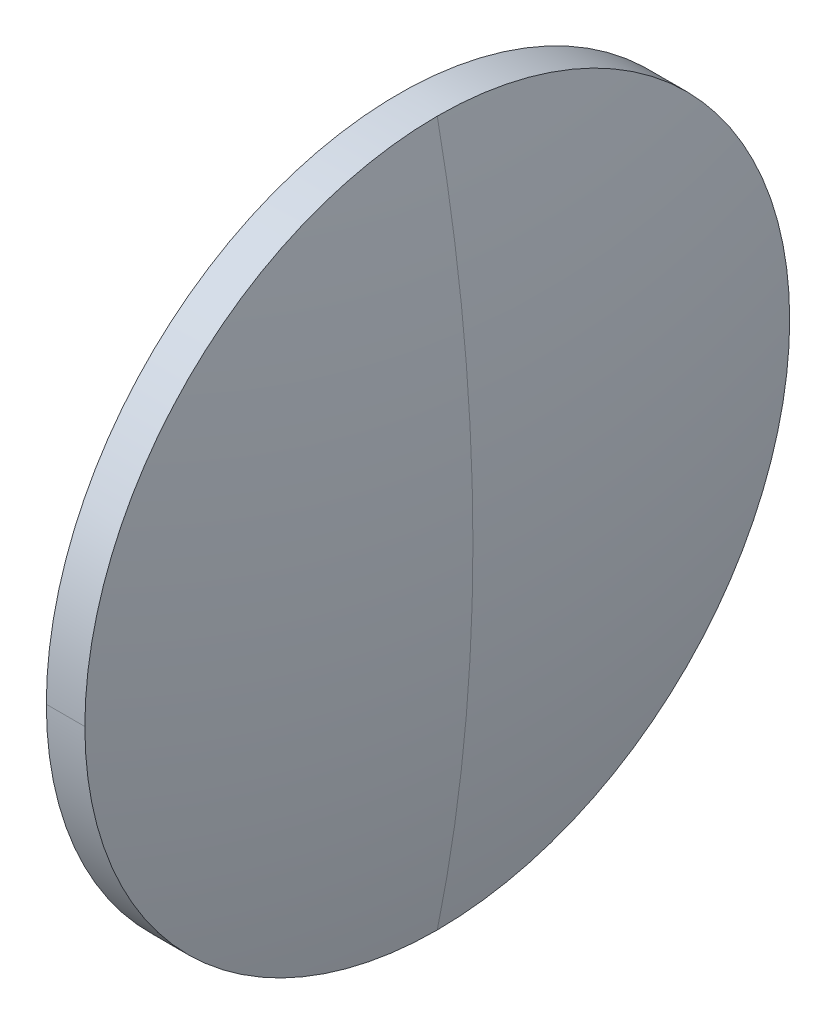
ISO-10303-21;
HEADER;
FILE_DESCRIPTION(('STEP AP214'),'2;1');
FILE_NAME('part.step','',(''),(''),'','','');
FILE_SCHEMA(('AUTOMOTIVE_DESIGN { 1 0 10303 214 1 1 1 1 }'));
ENDSEC;
DATA;
#1=APPLICATION_CONTEXT('core data for automotive mechanical design processes');
#2=APPLICATION_PROTOCOL_DEFINITION('international standard','automotive_design',2000,#1);
#3=PRODUCT_CONTEXT('',#1,'mechanical');
#4=PRODUCT('Part','Part','',(#3));
#5=PRODUCT_RELATED_PRODUCT_CATEGORY('part','',(#4));
#6=PRODUCT_DEFINITION_FORMATION('','',#4);
#7=PRODUCT_DEFINITION_CONTEXT('part definition',#1,'design');
#8=PRODUCT_DEFINITION('design','',#6,#7);
#9=PRODUCT_DEFINITION_SHAPE('','',#8);
#10=(LENGTH_UNIT() NAMED_UNIT(*) SI_UNIT(.MILLI.,.METRE.));
#11=(NAMED_UNIT(*) PLANE_ANGLE_UNIT() SI_UNIT($,.RADIAN.));
#12=(NAMED_UNIT(*) SI_UNIT($,.STERADIAN.) SOLID_ANGLE_UNIT());
#13=UNCERTAINTY_MEASURE_WITH_UNIT(LENGTH_MEASURE(1.E-05),#10,'distance_accuracy_value','');
#14=(GEOMETRIC_REPRESENTATION_CONTEXT(3) GLOBAL_UNCERTAINTY_ASSIGNED_CONTEXT((#13)) GLOBAL_UNIT_ASSIGNED_CONTEXT((#10,
#11,#12)) REPRESENTATION_CONTEXT('',''));
#15=CARTESIAN_POINT('',(0.,0.,0.));
#16=DIRECTION('',(0.,0.,1.));
#17=DIRECTION('',(1.,0.,0.));
#18=AXIS2_PLACEMENT_3D('',#15,#16,#17);
#19=CARTESIAN_POINT('',(2807.77536665739,-224.917697129705,0.));
#20=DIRECTION('',(-1.,0.,0.));
#21=DIRECTION('',(0.,0.,1.));
#22=AXIS2_PLACEMENT_3D('',#19,#20,#21);
#23=CYLINDRICAL_SURFACE('',#22,19.0000004602766);
#24=DIRECTION('',(-1.,0.,0.));
#25=VECTOR('',#24,1.);
#26=CARTESIAN_POINT('',(2807.77536665739,-224.917697129705,-19.0000004602766));
#27=LINE('',#26,#25);
#28=CARTESIAN_POINT('',(2816.62047491904,-224.917697129705,-19.0000004602766));
#29=VERTEX_POINT('',#28);
#30=CARTESIAN_POINT('',(2814.54281325368,-224.917697129705,-19.0000004602766));
#31=VERTEX_POINT('',#30);
#32=EDGE_CURVE('E89',#29,#31,#27,.T.);
#33=ORIENTED_EDGE('',*,*,#32,.F.);
#34=CARTESIAN_POINT('',(2816.62047491904,-224.917697129705,0.));
#35=DIRECTION('',(-1.,0.,0.));
#36=DIRECTION('',(0.,0.,1.));
#37=AXIS2_PLACEMENT_3D('',#34,#35,#36);
#38=CIRCLE('',#37,19.0000004602766);
#39=CARTESIAN_POINT('',(2816.62047491904,-243.917697589982,0.));
#40=VERTEX_POINT('',#39);
#41=EDGE_CURVE('E67',#29,#40,#38,.T.);
#42=ORIENTED_EDGE('',*,*,#41,.T.);
#43=CARTESIAN_POINT('',(2816.62047491904,-224.917697129705,0.));
#44=DIRECTION('',(-1.,0.,0.));
#45=DIRECTION('',(0.,0.,1.));
#46=AXIS2_PLACEMENT_3D('',#43,#44,#45);
#47=CIRCLE('',#46,19.0000004602766);
#48=CARTESIAN_POINT('',(2816.62047491904,-224.917697129705,19.0000004602766));
#49=VERTEX_POINT('',#48);
#50=EDGE_CURVE('E9',#40,#49,#47,.T.);
#51=ORIENTED_EDGE('',*,*,#50,.T.);
#52=DIRECTION('',(-1.,0.,0.));
#53=VECTOR('',#52,1.);
#54=CARTESIAN_POINT('',(2807.77536665739,-224.917697129705,19.0000004602766));
#55=LINE('',#54,#53);
#56=CARTESIAN_POINT('',(2814.54281325368,-224.917697129705,19.0000004602766));
#57=VERTEX_POINT('',#56);
#58=EDGE_CURVE('E85',#49,#57,#55,.T.);
#59=ORIENTED_EDGE('',*,*,#58,.T.);
#60=CARTESIAN_POINT('',(2814.54281325368,-224.917697129705,0.));
#61=DIRECTION('',(-1.,0.,0.));
#62=DIRECTION('',(0.,0.,1.));
#63=AXIS2_PLACEMENT_3D('',#60,#61,#62);
#64=CIRCLE('',#63,19.0000004602766);
#65=EDGE_CURVE('E26',#31,#57,#64,.T.);
#66=ORIENTED_EDGE('',*,*,#65,.F.);
#67=EDGE_LOOP('',(#33,#42,#51,#59,#66));
#68=FACE_BOUND('',#67,.T.);
#69=ADVANCED_FACE('F15',(#68),#23,.T.);
#70=CARTESIAN_POINT('',(2723.68557725369,-224.917697129705,0.));
#71=DIRECTION('',(0.,0.,-1.));
#72=DIRECTION('',(0.,1.,0.));
#73=AXIS2_PLACEMENT_3D('',#70,#71,#72);
#74=SPHERICAL_SURFACE('',#73,94.8572360000001);
#75=CARTESIAN_POINT('',(2723.68557725369,-224.917697129705,0.));
#76=DIRECTION('',(0.,0.,-1.));
#77=DIRECTION('',(0.,1.,0.));
#78=AXIS2_PLACEMENT_3D('',#75,#76,#77);
#79=CIRCLE('',#78,94.8572360000001);
#80=CARTESIAN_POINT('',(2818.54281325368,-224.917697129705,0.));
#81=VERTEX_POINT('',#80);
#82=EDGE_CURVE('E19',#81,#40,#79,.T.);
#83=ORIENTED_EDGE('',*,*,#82,.F.);
#84=CARTESIAN_POINT('',(2723.68557725369,-224.917697129705,0.));
#85=DIRECTION('',(0.,0.,1.));
#86=DIRECTION('',(1.,0.,0.));
#87=AXIS2_PLACEMENT_3D('',#84,#85,#86);
#88=CIRCLE('',#87,94.8572360000002);
#89=CARTESIAN_POINT('',(2816.62047491904,-205.917696669428,0.));
#90=VERTEX_POINT('',#89);
#91=EDGE_CURVE('E73',#81,#90,#88,.T.);
#92=ORIENTED_EDGE('',*,*,#91,.T.);
#93=CARTESIAN_POINT('',(2816.62047491904,-224.917697129705,0.));
#94=DIRECTION('',(-1.,0.,0.));
#95=DIRECTION('',(0.,0.,1.));
#96=AXIS2_PLACEMENT_3D('',#93,#94,#95);
#97=CIRCLE('',#96,19.0000004602766);
#98=EDGE_CURVE('E75',#49,#90,#97,.T.);
#99=ORIENTED_EDGE('',*,*,#98,.F.);
#100=ORIENTED_EDGE('',*,*,#50,.F.);
#101=EDGE_LOOP('',(#83,#92,#99,#100));
#102=FACE_BOUND('',#101,.T.);
#103=ADVANCED_FACE('F17',(#102),#74,.T.);
#104=CARTESIAN_POINT('',(2814.54281325368,0.,0.));
#105=DIRECTION('',(-1.,0.,0.));
#106=DIRECTION('',(0.,0.,1.));
#107=AXIS2_PLACEMENT_3D('',#104,#105,#106);
#108=PLANE('',#107);
#109=CARTESIAN_POINT('',(2814.54281325368,-224.917697129705,0.));
#110=DIRECTION('',(-1.,0.,0.));
#111=DIRECTION('',(0.,0.,1.));
#112=AXIS2_PLACEMENT_3D('',#109,#110,#111);
#113=CIRCLE('',#112,19.0000004602766);
#114=EDGE_CURVE('E95',#57,#31,#113,.T.);
#115=ORIENTED_EDGE('',*,*,#114,.T.);
#116=ORIENTED_EDGE('',*,*,#65,.T.);
#117=EDGE_LOOP('',(#115,#116));
#118=FACE_BOUND('',#117,.T.);
#119=ADVANCED_FACE('F109',(#118),#108,.T.);
#120=CARTESIAN_POINT('',(2723.68557725369,-224.917697129705,0.));
#121=DIRECTION('',(0.,0.,-1.));
#122=DIRECTION('',(0.,1.,0.));
#123=AXIS2_PLACEMENT_3D('',#120,#121,#122);
#124=SPHERICAL_SURFACE('',#123,94.8572360000001);
#125=ORIENTED_EDGE('',*,*,#91,.F.);
#126=ORIENTED_EDGE('',*,*,#82,.T.);
#127=ORIENTED_EDGE('',*,*,#41,.F.);
#128=CARTESIAN_POINT('',(2816.62047491904,-224.917697129705,0.));
#129=DIRECTION('',(-1.,0.,0.));
#130=DIRECTION('',(0.,0.,1.));
#131=AXIS2_PLACEMENT_3D('',#128,#129,#130);
#132=CIRCLE('',#131,19.0000004602766);
#133=EDGE_CURVE('E83',#90,#29,#132,.T.);
#134=ORIENTED_EDGE('',*,*,#133,.F.);
#135=EDGE_LOOP('',(#125,#126,#127,#134));
#136=FACE_BOUND('',#135,.T.);
#137=ADVANCED_FACE('F87',(#136),#124,.T.);
#138=CARTESIAN_POINT('',(2807.77536665739,-224.917697129705,0.));
#139=DIRECTION('',(-1.,0.,0.));
#140=DIRECTION('',(0.,0.,1.));
#141=AXIS2_PLACEMENT_3D('',#138,#139,#140);
#142=CYLINDRICAL_SURFACE('',#141,19.0000004602766);
#143=ORIENTED_EDGE('',*,*,#133,.T.);
#144=ORIENTED_EDGE('',*,*,#32,.T.);
#145=ORIENTED_EDGE('',*,*,#114,.F.);
#146=ORIENTED_EDGE('',*,*,#58,.F.);
#147=ORIENTED_EDGE('',*,*,#98,.T.);
#148=EDGE_LOOP('',(#143,#144,#145,#146,#147));
#149=FACE_BOUND('',#148,.T.);
#150=ADVANCED_FACE('F81',(#149),#142,.T.);
#151=CLOSED_SHELL('',(#69,#103,#119,#137,#150));
#152=MANIFOLD_SOLID_BREP('B1',#151);
#153=ADVANCED_BREP_SHAPE_REPRESENTATION('',(#18,#152),#14);
#154=SHAPE_DEFINITION_REPRESENTATION(#9,#153);
ENDSEC;
END-ISO-10303-21;
